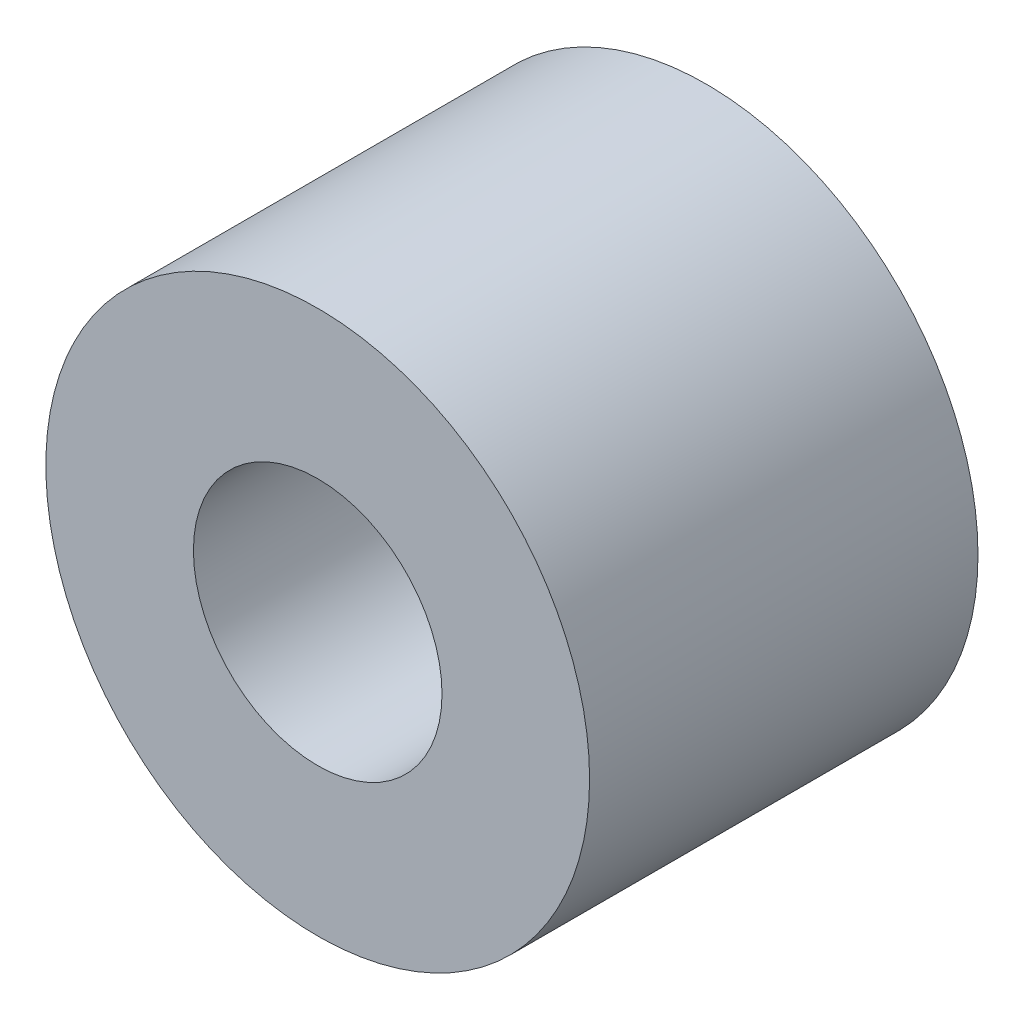
ISO-10303-21;
HEADER;
FILE_DESCRIPTION(('STEP AP214'),'2;1');
FILE_NAME('part.step','',(''),(''),'','','');
FILE_SCHEMA(('AUTOMOTIVE_DESIGN { 1 0 10303 214 1 1 1 1 }'));
ENDSEC;
DATA;
#1=APPLICATION_CONTEXT('core data for automotive mechanical design processes');
#2=APPLICATION_PROTOCOL_DEFINITION('international standard','automotive_design',2000,#1);
#3=PRODUCT_CONTEXT('',#1,'mechanical');
#4=PRODUCT('Part','Part','',(#3));
#5=PRODUCT_RELATED_PRODUCT_CATEGORY('part','',(#4));
#6=PRODUCT_DEFINITION_FORMATION('','',#4);
#7=PRODUCT_DEFINITION_CONTEXT('part definition',#1,'design');
#8=PRODUCT_DEFINITION('design','',#6,#7);
#9=PRODUCT_DEFINITION_SHAPE('','',#8);
#10=(LENGTH_UNIT() NAMED_UNIT(*) SI_UNIT(.MILLI.,.METRE.));
#11=(NAMED_UNIT(*) PLANE_ANGLE_UNIT() SI_UNIT($,.RADIAN.));
#12=(NAMED_UNIT(*) SI_UNIT($,.STERADIAN.) SOLID_ANGLE_UNIT());
#13=UNCERTAINTY_MEASURE_WITH_UNIT(LENGTH_MEASURE(1.E-05),#10,'distance_accuracy_value','');
#14=(GEOMETRIC_REPRESENTATION_CONTEXT(3) GLOBAL_UNCERTAINTY_ASSIGNED_CONTEXT((#13)) GLOBAL_UNIT_ASSIGNED_CONTEXT((#10,
#11,#12)) REPRESENTATION_CONTEXT('',''));
#15=CARTESIAN_POINT('',(0.,0.,0.));
#16=DIRECTION('',(0.,0.,1.));
#17=DIRECTION('',(1.,0.,0.));
#18=AXIS2_PLACEMENT_3D('',#15,#16,#17);
#19=CARTESIAN_POINT('',(0.,0.,5.));
#20=DIRECTION('',(0.,0.,1.));
#21=DIRECTION('',(1.,0.,0.));
#22=AXIS2_PLACEMENT_3D('',#19,#20,#21);
#23=PLANE('',#22);
#24=CARTESIAN_POINT('',(0.,0.,5.));
#25=DIRECTION('',(0.,0.,1.));
#26=DIRECTION('',(1.,0.,0.));
#27=AXIS2_PLACEMENT_3D('',#24,#25,#26);
#28=CIRCLE('',#27,3.5);
#29=CARTESIAN_POINT('',(3.5,0.,5.));
#30=VERTEX_POINT('',#29);
#31=EDGE_CURVE('E10',#30,#30,#28,.T.);
#32=ORIENTED_EDGE('',*,*,#31,.T.);
#33=EDGE_LOOP('',(#32));
#34=FACE_BOUND('',#33,.T.);
#35=CARTESIAN_POINT('',(0.,0.,5.));
#36=DIRECTION('',(0.,0.,1.));
#37=DIRECTION('',(1.,0.,0.));
#38=AXIS2_PLACEMENT_3D('',#35,#36,#37);
#39=CIRCLE('',#38,1.6);
#40=CARTESIAN_POINT('',(1.6,0.,5.));
#41=VERTEX_POINT('',#40);
#42=EDGE_CURVE('E50',#41,#41,#39,.T.);
#43=ORIENTED_EDGE('',*,*,#42,.F.);
#44=EDGE_LOOP('',(#43));
#45=FACE_BOUND('',#44,.T.);
#46=ADVANCED_FACE('F37',(#34,#45),#23,.T.);
#47=CARTESIAN_POINT('',(0.,0.,0.));
#48=DIRECTION('',(0.,0.,1.));
#49=DIRECTION('',(1.,0.,0.));
#50=AXIS2_PLACEMENT_3D('',#47,#48,#49);
#51=PLANE('',#50);
#52=CARTESIAN_POINT('',(0.,0.,0.));
#53=DIRECTION('',(0.,0.,1.));
#54=DIRECTION('',(1.,0.,0.));
#55=AXIS2_PLACEMENT_3D('',#52,#53,#54);
#56=CIRCLE('',#55,3.5);
#57=CARTESIAN_POINT('',(3.5,0.,0.));
#58=VERTEX_POINT('',#57);
#59=EDGE_CURVE('E41',#58,#58,#56,.T.);
#60=ORIENTED_EDGE('',*,*,#59,.F.);
#61=EDGE_LOOP('',(#60));
#62=FACE_BOUND('',#61,.T.);
#63=CARTESIAN_POINT('',(0.,0.,0.));
#64=DIRECTION('',(0.,0.,1.));
#65=DIRECTION('',(1.,0.,0.));
#66=AXIS2_PLACEMENT_3D('',#63,#64,#65);
#67=CIRCLE('',#66,1.6);
#68=CARTESIAN_POINT('',(1.6,0.,0.));
#69=VERTEX_POINT('',#68);
#70=EDGE_CURVE('E52',#69,#69,#67,.T.);
#71=ORIENTED_EDGE('',*,*,#70,.T.);
#72=EDGE_LOOP('',(#71));
#73=FACE_BOUND('',#72,.T.);
#74=ADVANCED_FACE('F64',(#62,#73),#51,.F.);
#75=CARTESIAN_POINT('',(0.,0.,5.));
#76=DIRECTION('',(0.,0.,-1.));
#77=DIRECTION('',(-1.,0.,0.));
#78=AXIS2_PLACEMENT_3D('',#75,#76,#77);
#79=CYLINDRICAL_SURFACE('',#78,3.5);
#80=ORIENTED_EDGE('',*,*,#31,.F.);
#81=EDGE_LOOP('',(#80));
#82=FACE_BOUND('',#81,.T.);
#83=ORIENTED_EDGE('',*,*,#59,.T.);
#84=EDGE_LOOP('',(#83));
#85=FACE_BOUND('',#84,.T.);
#86=ADVANCED_FACE('F39',(#82,#85),#79,.T.);
#87=CARTESIAN_POINT('',(0.,0.,5.));
#88=DIRECTION('',(0.,0.,-1.));
#89=DIRECTION('',(-1.,0.,0.));
#90=AXIS2_PLACEMENT_3D('',#87,#88,#89);
#91=CYLINDRICAL_SURFACE('',#90,1.6);
#92=ORIENTED_EDGE('',*,*,#42,.T.);
#93=EDGE_LOOP('',(#92));
#94=FACE_BOUND('',#93,.T.);
#95=ORIENTED_EDGE('',*,*,#70,.F.);
#96=EDGE_LOOP('',(#95));
#97=FACE_BOUND('',#96,.T.);
#98=ADVANCED_FACE('F60',(#94,#97),#91,.F.);
#99=CLOSED_SHELL('',(#46,#74,#86,#98));
#100=MANIFOLD_SOLID_BREP('B2',#99);
#101=ADVANCED_BREP_SHAPE_REPRESENTATION('',(#18,#100),#14);
#102=SHAPE_DEFINITION_REPRESENTATION(#9,#101);
ENDSEC;
END-ISO-10303-21;
